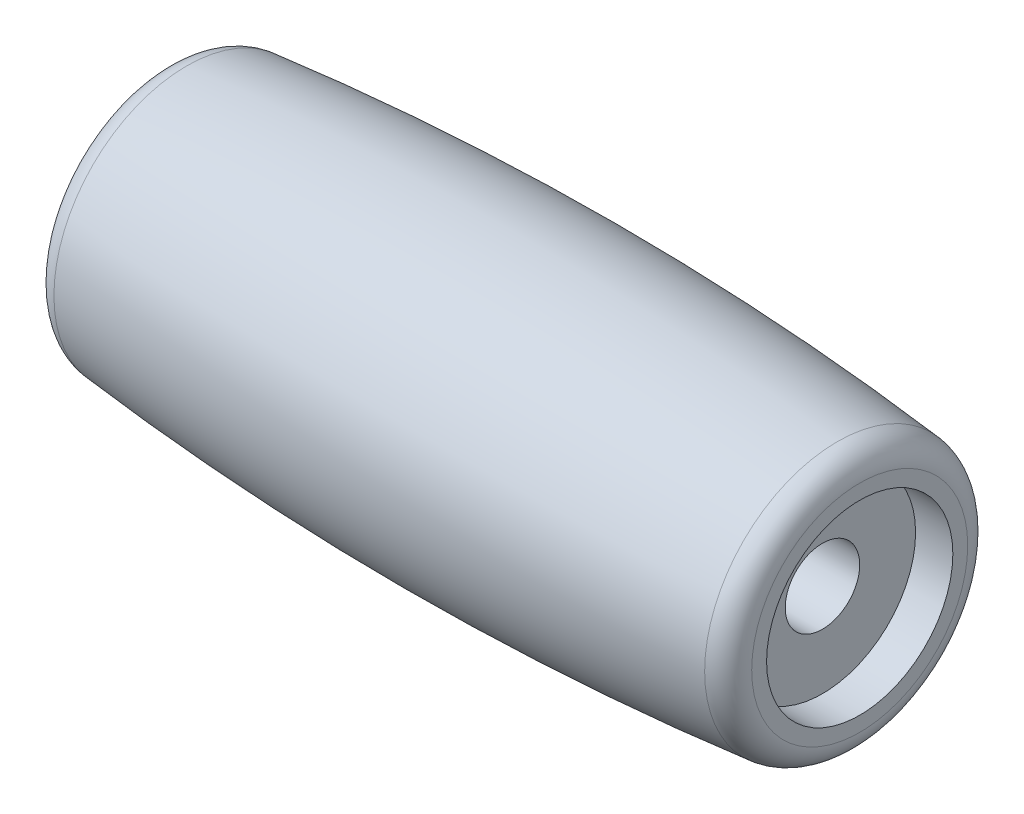
ISO-10303-21;
HEADER;
FILE_DESCRIPTION(('STEP AP214'),'2;1');
FILE_NAME('part.step','',(''),(''),'','','');
FILE_SCHEMA(('AUTOMOTIVE_DESIGN { 1 0 10303 214 1 1 1 1 }'));
ENDSEC;
DATA;
#1=APPLICATION_CONTEXT('core data for automotive mechanical design processes');
#2=APPLICATION_PROTOCOL_DEFINITION('international standard','automotive_design',2000,#1);
#3=PRODUCT_CONTEXT('',#1,'mechanical');
#4=PRODUCT('Part','Part','',(#3));
#5=PRODUCT_RELATED_PRODUCT_CATEGORY('part','',(#4));
#6=PRODUCT_DEFINITION_FORMATION('','',#4);
#7=PRODUCT_DEFINITION_CONTEXT('part definition',#1,'design');
#8=PRODUCT_DEFINITION('design','',#6,#7);
#9=PRODUCT_DEFINITION_SHAPE('','',#8);
#10=(LENGTH_UNIT() NAMED_UNIT(*) SI_UNIT(.MILLI.,.METRE.));
#11=(NAMED_UNIT(*) PLANE_ANGLE_UNIT() SI_UNIT($,.RADIAN.));
#12=(NAMED_UNIT(*) SI_UNIT($,.STERADIAN.) SOLID_ANGLE_UNIT());
#13=UNCERTAINTY_MEASURE_WITH_UNIT(LENGTH_MEASURE(1.E-05),#10,'distance_accuracy_value','');
#14=(GEOMETRIC_REPRESENTATION_CONTEXT(3) GLOBAL_UNCERTAINTY_ASSIGNED_CONTEXT((#13)) GLOBAL_UNIT_ASSIGNED_CONTEXT((#10,
#11,#12)) REPRESENTATION_CONTEXT('',''));
#15=CARTESIAN_POINT('',(0.,0.,0.));
#16=DIRECTION('',(0.,0.,1.));
#17=DIRECTION('',(1.,0.,0.));
#18=AXIS2_PLACEMENT_3D('',#15,#16,#17);
#19=CARTESIAN_POINT('',(-25.,3.,0.));
#20=DIRECTION('',(1.,0.,0.));
#21=DIRECTION('',(0.,0.,1.));
#22=AXIS2_PLACEMENT_3D('',#19,#20,#21);
#23=PLANE('',#22);
#24=CARTESIAN_POINT('',(-25.,0.,0.));
#25=DIRECTION('',(1.,0.,0.));
#26=DIRECTION('',(0.,0.,-1.));
#27=AXIS2_PLACEMENT_3D('',#24,#25,#26);
#28=CIRCLE('',#27,3.);
#29=CARTESIAN_POINT('',(-25.,0.,-3.));
#30=VERTEX_POINT('',#29);
#31=EDGE_CURVE('E73',#30,#30,#28,.T.);
#32=ORIENTED_EDGE('',*,*,#31,.T.);
#33=EDGE_LOOP('',(#32));
#34=FACE_BOUND('',#33,.T.);
#35=CARTESIAN_POINT('',(-25.,0.,0.));
#36=DIRECTION('',(1.,0.,0.));
#37=DIRECTION('',(0.,0.,-1.));
#38=AXIS2_PLACEMENT_3D('',#35,#36,#37);
#39=CIRCLE('',#38,7.49999999999999);
#40=CARTESIAN_POINT('',(-25.,0.,-7.49999999999999));
#41=VERTEX_POINT('',#40);
#42=EDGE_CURVE('E10',#41,#41,#39,.T.);
#43=ORIENTED_EDGE('',*,*,#42,.F.);
#44=EDGE_LOOP('',(#43));
#45=FACE_BOUND('',#44,.T.);
#46=ADVANCED_FACE('F39',(#34,#45),#23,.F.);
#47=CARTESIAN_POINT('',(0.,0.,0.));
#48=DIRECTION('',(-1.,0.,0.));
#49=DIRECTION('',(0.,0.,-1.));
#50=AXIS2_PLACEMENT_3D('',#47,#48,#49);
#51=CYLINDRICAL_SURFACE('',#50,7.49999999999999);
#52=ORIENTED_EDGE('',*,*,#42,.T.);
#53=EDGE_LOOP('',(#52));
#54=FACE_BOUND('',#53,.T.);
#55=CARTESIAN_POINT('',(-28.,0.,0.));
#56=DIRECTION('',(1.,0.,0.));
#57=DIRECTION('',(0.,0.,-1.));
#58=AXIS2_PLACEMENT_3D('',#55,#56,#57);
#59=CIRCLE('',#58,7.49999999999999);
#60=CARTESIAN_POINT('',(-28.,0.,-7.49999999999999));
#61=VERTEX_POINT('',#60);
#62=EDGE_CURVE('E45',#61,#61,#59,.T.);
#63=ORIENTED_EDGE('',*,*,#62,.F.);
#64=EDGE_LOOP('',(#63));
#65=FACE_BOUND('',#64,.T.);
#66=ADVANCED_FACE('F91',(#54,#65),#51,.F.);
#67=CARTESIAN_POINT('',(-28.,7.49999999999999,0.));
#68=DIRECTION('',(1.,0.,0.));
#69=DIRECTION('',(0.,0.,1.));
#70=AXIS2_PLACEMENT_3D('',#67,#68,#69);
#71=PLANE('',#70);
#72=ORIENTED_EDGE('',*,*,#62,.T.);
#73=EDGE_LOOP('',(#72));
#74=FACE_BOUND('',#73,.T.);
#75=CARTESIAN_POINT('',(-28.,0.,0.));
#76=DIRECTION('',(1.,0.,0.));
#77=DIRECTION('',(0.,0.,-1.));
#78=AXIS2_PLACEMENT_3D('',#75,#76,#77);
#79=CIRCLE('',#78,8.69715333012776);
#80=CARTESIAN_POINT('',(-28.,0.,-8.69715333012776));
#81=VERTEX_POINT('',#80);
#82=EDGE_CURVE('E49',#81,#81,#79,.T.);
#83=ORIENTED_EDGE('',*,*,#82,.F.);
#84=EDGE_LOOP('',(#83));
#85=FACE_BOUND('',#84,.T.);
#86=ADVANCED_FACE('F95',(#74,#85),#71,.F.);
#87=CARTESIAN_POINT('',(-26.,0.,0.));
#88=DIRECTION('',(-1.,0.,0.));
#89=DIRECTION('',(0.,0.,-1.));
#90=AXIS2_PLACEMENT_3D('',#87,#88,#89);
#91=TOROIDAL_SURFACE('',#90,8.69715333012776,2.00000000000003);
#92=ORIENTED_EDGE('',*,*,#82,.T.);
#93=EDGE_LOOP('',(#92));
#94=FACE_BOUND('',#93,.T.);
#95=CARTESIAN_POINT('',(-26.199935917975,0.,0.));
#96=DIRECTION('',(1.,0.,0.));
#97=DIRECTION('',(0.,0.,-1.));
#98=AXIS2_PLACEMENT_3D('',#95,#96,#97);
#99=CIRCLE('',#98,10.6871346437846);
#100=CARTESIAN_POINT('',(-26.199935917975,0.,-10.6871346437846));
#101=VERTEX_POINT('',#100);
#102=EDGE_CURVE('E53',#101,#101,#99,.T.);
#103=ORIENTED_EDGE('',*,*,#102,.F.);
#104=EDGE_LOOP('',(#103));
#105=FACE_BOUND('',#104,.T.);
#106=ADVANCED_FACE('F99',(#94,#105),#91,.T.);
#107=CARTESIAN_POINT('',(0.,0.,0.));
#108=DIRECTION('',(-1.,0.,0.));
#109=DIRECTION('',(0.,0.,-1.));
#110=AXIS2_PLACEMENT_3D('',#107,#108,#109);
#111=DEGENERATE_TOROIDAL_SURFACE('',#110,250.083333333333,262.083333333333,.F.);
#112=ORIENTED_EDGE('',*,*,#102,.T.);
#113=EDGE_LOOP('',(#112));
#114=FACE_BOUND('',#113,.T.);
#115=CARTESIAN_POINT('',(26.199935917975,0.,0.));
#116=DIRECTION('',(1.,0.,0.));
#117=DIRECTION('',(0.,0.,-1.));
#118=AXIS2_PLACEMENT_3D('',#115,#116,#117);
#119=CIRCLE('',#118,10.6871346437847);
#120=CARTESIAN_POINT('',(26.199935917975,0.,-10.6871346437847));
#121=VERTEX_POINT('',#120);
#122=EDGE_CURVE('E58',#121,#121,#119,.T.);
#123=ORIENTED_EDGE('',*,*,#122,.F.);
#124=EDGE_LOOP('',(#123));
#125=FACE_BOUND('',#124,.T.);
#126=ADVANCED_FACE('F105',(#114,#125),#111,.F.);
#127=CARTESIAN_POINT('',(26.,0.,0.));
#128=DIRECTION('',(-1.,0.,0.));
#129=DIRECTION('',(0.,0.,-1.));
#130=AXIS2_PLACEMENT_3D('',#127,#128,#129);
#131=TOROIDAL_SURFACE('',#130,8.69715333012782,2.);
#132=ORIENTED_EDGE('',*,*,#122,.T.);
#133=EDGE_LOOP('',(#132));
#134=FACE_BOUND('',#133,.T.);
#135=CARTESIAN_POINT('',(28.,0.,0.));
#136=DIRECTION('',(1.,0.,0.));
#137=DIRECTION('',(0.,0.,-1.));
#138=AXIS2_PLACEMENT_3D('',#135,#136,#137);
#139=CIRCLE('',#138,8.69715333012782);
#140=CARTESIAN_POINT('',(28.,0.,-8.69715333012782));
#141=VERTEX_POINT('',#140);
#142=EDGE_CURVE('E61',#141,#141,#139,.T.);
#143=ORIENTED_EDGE('',*,*,#142,.F.);
#144=EDGE_LOOP('',(#143));
#145=FACE_BOUND('',#144,.T.);
#146=ADVANCED_FACE('F109',(#134,#145),#131,.T.);
#147=CARTESIAN_POINT('',(28.,7.5,0.));
#148=DIRECTION('',(-1.,0.,0.));
#149=DIRECTION('',(0.,0.,-1.));
#150=AXIS2_PLACEMENT_3D('',#147,#148,#149);
#151=PLANE('',#150);
#152=ORIENTED_EDGE('',*,*,#142,.T.);
#153=EDGE_LOOP('',(#152));
#154=FACE_BOUND('',#153,.T.);
#155=CARTESIAN_POINT('',(28.,0.,0.));
#156=DIRECTION('',(1.,0.,0.));
#157=DIRECTION('',(0.,0.,-1.));
#158=AXIS2_PLACEMENT_3D('',#155,#156,#157);
#159=CIRCLE('',#158,7.5);
#160=CARTESIAN_POINT('',(28.,0.,-7.5));
#161=VERTEX_POINT('',#160);
#162=EDGE_CURVE('E64',#161,#161,#159,.T.);
#163=ORIENTED_EDGE('',*,*,#162,.F.);
#164=EDGE_LOOP('',(#163));
#165=FACE_BOUND('',#164,.T.);
#166=ADVANCED_FACE('F113',(#154,#165),#151,.F.);
#167=CARTESIAN_POINT('',(0.,0.,0.));
#168=DIRECTION('',(-1.,0.,0.));
#169=DIRECTION('',(0.,0.,-1.));
#170=AXIS2_PLACEMENT_3D('',#167,#168,#169);
#171=CYLINDRICAL_SURFACE('',#170,7.5);
#172=ORIENTED_EDGE('',*,*,#162,.T.);
#173=EDGE_LOOP('',(#172));
#174=FACE_BOUND('',#173,.T.);
#175=CARTESIAN_POINT('',(25.,0.,0.));
#176=DIRECTION('',(1.,0.,0.));
#177=DIRECTION('',(0.,0.,-1.));
#178=AXIS2_PLACEMENT_3D('',#175,#176,#177);
#179=CIRCLE('',#178,7.5);
#180=CARTESIAN_POINT('',(25.,0.,-7.5));
#181=VERTEX_POINT('',#180);
#182=EDGE_CURVE('E67',#181,#181,#179,.T.);
#183=ORIENTED_EDGE('',*,*,#182,.F.);
#184=EDGE_LOOP('',(#183));
#185=FACE_BOUND('',#184,.T.);
#186=ADVANCED_FACE('F87',(#174,#185),#171,.F.);
#187=CARTESIAN_POINT('',(25.,3.,0.));
#188=DIRECTION('',(-1.,0.,0.));
#189=DIRECTION('',(0.,0.,-1.));
#190=AXIS2_PLACEMENT_3D('',#187,#188,#189);
#191=PLANE('',#190);
#192=ORIENTED_EDGE('',*,*,#182,.T.);
#193=EDGE_LOOP('',(#192));
#194=FACE_BOUND('',#193,.T.);
#195=CARTESIAN_POINT('',(25.,0.,0.));
#196=DIRECTION('',(1.,0.,0.));
#197=DIRECTION('',(0.,0.,-1.));
#198=AXIS2_PLACEMENT_3D('',#195,#196,#197);
#199=CIRCLE('',#198,3.);
#200=CARTESIAN_POINT('',(25.,0.,-3.));
#201=VERTEX_POINT('',#200);
#202=EDGE_CURVE('E70',#201,#201,#199,.T.);
#203=ORIENTED_EDGE('',*,*,#202,.F.);
#204=EDGE_LOOP('',(#203));
#205=FACE_BOUND('',#204,.T.);
#206=ADVANCED_FACE('F81',(#194,#205),#191,.F.);
#207=CARTESIAN_POINT('',(0.,0.,0.));
#208=DIRECTION('',(-1.,0.,0.));
#209=DIRECTION('',(0.,0.,-1.));
#210=AXIS2_PLACEMENT_3D('',#207,#208,#209);
#211=CYLINDRICAL_SURFACE('',#210,3.);
#212=ORIENTED_EDGE('',*,*,#202,.T.);
#213=EDGE_LOOP('',(#212));
#214=FACE_BOUND('',#213,.T.);
#215=ORIENTED_EDGE('',*,*,#31,.F.);
#216=EDGE_LOOP('',(#215));
#217=FACE_BOUND('',#216,.T.);
#218=ADVANCED_FACE('F79',(#214,#217),#211,.F.);
#219=CLOSED_SHELL('',(#46,#66,#86,#106,#126,#146,#166,#186,#206,#218));
#220=MANIFOLD_SOLID_BREP('B2',#219);
#221=ADVANCED_BREP_SHAPE_REPRESENTATION('',(#18,#220),#14);
#222=SHAPE_DEFINITION_REPRESENTATION(#9,#221);
ENDSEC;
END-ISO-10303-21;
